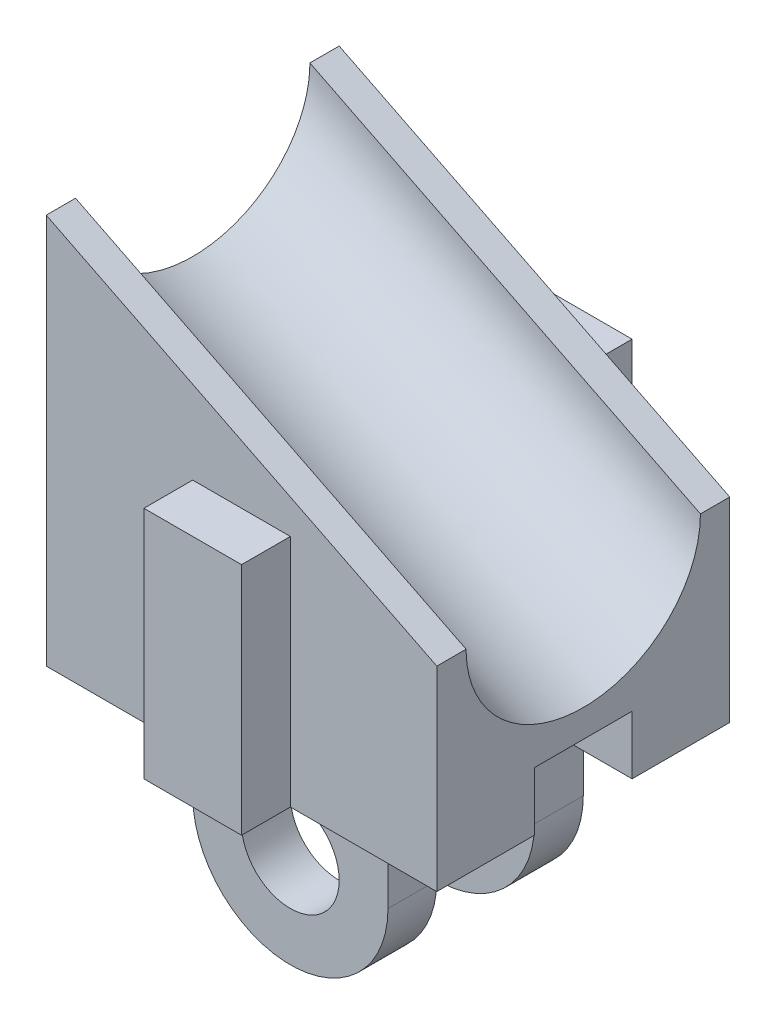
ISO-10303-21;
HEADER;
FILE_DESCRIPTION(('STEP AP214'),'2;1');
FILE_NAME('part.step','',(''),(''),'','','');
FILE_SCHEMA(('AUTOMOTIVE_DESIGN { 1 0 10303 214 1 1 1 1 }'));
ENDSEC;
DATA;
#1=APPLICATION_CONTEXT('core data for automotive mechanical design processes');
#2=APPLICATION_PROTOCOL_DEFINITION('international standard','automotive_design',2000,#1);
#3=PRODUCT_CONTEXT('',#1,'mechanical');
#4=PRODUCT('Part','Part','',(#3));
#5=PRODUCT_RELATED_PRODUCT_CATEGORY('part','',(#4));
#6=PRODUCT_DEFINITION_FORMATION('','',#4);
#7=PRODUCT_DEFINITION_CONTEXT('part definition',#1,'design');
#8=PRODUCT_DEFINITION('design','',#6,#7);
#9=PRODUCT_DEFINITION_SHAPE('','',#8);
#10=(LENGTH_UNIT() NAMED_UNIT(*) SI_UNIT(.MILLI.,.METRE.));
#11=(NAMED_UNIT(*) PLANE_ANGLE_UNIT() SI_UNIT($,.RADIAN.));
#12=(NAMED_UNIT(*) SI_UNIT($,.STERADIAN.) SOLID_ANGLE_UNIT());
#13=UNCERTAINTY_MEASURE_WITH_UNIT(LENGTH_MEASURE(1.E-05),#10,'distance_accuracy_value','');
#14=(GEOMETRIC_REPRESENTATION_CONTEXT(3) GLOBAL_UNCERTAINTY_ASSIGNED_CONTEXT((#13)) GLOBAL_UNIT_ASSIGNED_CONTEXT((#10,
#11,#12)) REPRESENTATION_CONTEXT('',''));
#15=CARTESIAN_POINT('',(0.,0.,0.));
#16=DIRECTION('',(0.,0.,1.));
#17=DIRECTION('',(1.,0.,0.));
#18=AXIS2_PLACEMENT_3D('',#15,#16,#17);
#19=CARTESIAN_POINT('',(0.,0.,-9.525));
#20=DIRECTION('',(0.,0.,-1.));
#21=DIRECTION('',(-1.,0.,0.));
#22=AXIS2_PLACEMENT_3D('',#19,#20,#21);
#23=PLANE('',#22);
#24=DIRECTION('',(-1.,0.,0.));
#25=VECTOR('',#24,1.);
#26=CARTESIAN_POINT('',(-3.175,2.54,-9.525));
#27=LINE('',#26,#25);
#28=CARTESIAN_POINT('',(3.175,2.54,-9.525));
#29=VERTEX_POINT('',#28);
#30=CARTESIAN_POINT('',(-3.175,2.54,-9.525));
#31=VERTEX_POINT('',#30);
#32=EDGE_CURVE('E435',#29,#31,#27,.T.);
#33=ORIENTED_EDGE('',*,*,#32,.T.);
#34=DIRECTION('',(0.,-1.,0.));
#35=VECTOR('',#34,1.);
#36=CARTESIAN_POINT('',(-3.175,-12.7,-9.525));
#37=LINE('',#36,#35);
#38=CARTESIAN_POINT('',(-3.175,-12.7,-9.525));
#39=VERTEX_POINT('',#38);
#40=EDGE_CURVE('E439',#31,#39,#37,.T.);
#41=ORIENTED_EDGE('',*,*,#40,.T.);
#42=DIRECTION('',(1.,0.,0.));
#43=VECTOR('',#42,1.);
#44=CARTESIAN_POINT('',(-12.7,-12.7,-9.525));
#45=LINE('',#44,#43);
#46=CARTESIAN_POINT('',(-12.7,-12.7,-9.525));
#47=VERTEX_POINT('',#46);
#48=EDGE_CURVE('E285',#47,#39,#45,.T.);
#49=ORIENTED_EDGE('',*,*,#48,.F.);
#50=DIRECTION('',(0.,-1.,0.));
#51=VECTOR('',#50,1.);
#52=CARTESIAN_POINT('',(-12.7,-12.7,-9.525));
#53=LINE('',#52,#51);
#54=CARTESIAN_POINT('',(-12.7,12.7,-9.525));
#55=VERTEX_POINT('',#54);
#56=EDGE_CURVE('E290',#55,#47,#53,.T.);
#57=ORIENTED_EDGE('',*,*,#56,.F.);
#58=DIRECTION('',(-0.894427190999916,0.447213595499958,0.));
#59=VECTOR('',#58,1.);
#60=CARTESIAN_POINT('',(-12.7,12.7,-9.525));
#61=LINE('',#60,#59);
#62=CARTESIAN_POINT('',(12.7,0.,-9.525));
#63=VERTEX_POINT('',#62);
#64=EDGE_CURVE('E279',#63,#55,#61,.T.);
#65=ORIENTED_EDGE('',*,*,#64,.F.);
#66=DIRECTION('',(0.,1.,0.));
#67=VECTOR('',#66,1.);
#68=CARTESIAN_POINT('',(12.7,-12.7,-9.525));
#69=LINE('',#68,#67);
#70=CARTESIAN_POINT('',(12.7,-12.7,-9.525));
#71=VERTEX_POINT('',#70);
#72=EDGE_CURVE('E266',#71,#63,#69,.T.);
#73=ORIENTED_EDGE('',*,*,#72,.F.);
#74=CARTESIAN_POINT('',(3.175,-12.7,-9.525));
#75=VERTEX_POINT('',#74);
#76=EDGE_CURVE('E289',#75,#71,#45,.T.);
#77=ORIENTED_EDGE('',*,*,#76,.F.);
#78=DIRECTION('',(0.,1.,0.));
#79=VECTOR('',#78,1.);
#80=CARTESIAN_POINT('',(3.175,-12.7,-9.525));
#81=LINE('',#80,#79);
#82=EDGE_CURVE('E430',#75,#29,#81,.T.);
#83=ORIENTED_EDGE('',*,*,#82,.T.);
#84=EDGE_LOOP('',(#33,#41,#49,#57,#65,#73,#77,#83));
#85=FACE_BOUND('',#84,.T.);
#86=ADVANCED_FACE('F39',(#85),#23,.T.);
#87=CARTESIAN_POINT('',(0.,0.,9.525));
#88=DIRECTION('',(0.,0.,-1.));
#89=DIRECTION('',(-1.,0.,0.));
#90=AXIS2_PLACEMENT_3D('',#87,#88,#89);
#91=PLANE('',#90);
#92=DIRECTION('',(0.,-1.,0.));
#93=VECTOR('',#92,1.);
#94=CARTESIAN_POINT('',(-3.175,-12.7,9.525));
#95=LINE('',#94,#93);
#96=CARTESIAN_POINT('',(-3.175,2.54,9.525));
#97=VERTEX_POINT('',#96);
#98=CARTESIAN_POINT('',(-3.175,-12.7,9.525));
#99=VERTEX_POINT('',#98);
#100=EDGE_CURVE('E357',#97,#99,#95,.T.);
#101=ORIENTED_EDGE('',*,*,#100,.F.);
#102=DIRECTION('',(-1.,0.,0.));
#103=VECTOR('',#102,1.);
#104=CARTESIAN_POINT('',(-3.175,2.54,9.525));
#105=LINE('',#104,#103);
#106=CARTESIAN_POINT('',(3.175,2.54,9.525));
#107=VERTEX_POINT('',#106);
#108=EDGE_CURVE('E348',#107,#97,#105,.T.);
#109=ORIENTED_EDGE('',*,*,#108,.F.);
#110=DIRECTION('',(0.,1.,0.));
#111=VECTOR('',#110,1.);
#112=CARTESIAN_POINT('',(3.175,-12.7,9.525));
#113=LINE('',#112,#111);
#114=CARTESIAN_POINT('',(3.17499999999999,-12.7,9.525));
#115=VERTEX_POINT('',#114);
#116=EDGE_CURVE('E353',#115,#107,#113,.T.);
#117=ORIENTED_EDGE('',*,*,#116,.F.);
#118=DIRECTION('',(1.,0.,0.));
#119=VECTOR('',#118,1.);
#120=CARTESIAN_POINT('',(-12.7,-12.7,9.525));
#121=LINE('',#120,#119);
#122=CARTESIAN_POINT('',(12.7,-12.7,9.525));
#123=VERTEX_POINT('',#122);
#124=EDGE_CURVE('E302',#115,#123,#121,.T.);
#125=ORIENTED_EDGE('',*,*,#124,.T.);
#126=DIRECTION('',(0.,1.,0.));
#127=VECTOR('',#126,1.);
#128=CARTESIAN_POINT('',(12.7,-12.7,9.525));
#129=LINE('',#128,#127);
#130=CARTESIAN_POINT('',(12.7,0.,9.525));
#131=VERTEX_POINT('',#130);
#132=EDGE_CURVE('E238',#123,#131,#129,.T.);
#133=ORIENTED_EDGE('',*,*,#132,.T.);
#134=DIRECTION('',(-0.894427190999916,0.447213595499958,0.));
#135=VECTOR('',#134,1.);
#136=CARTESIAN_POINT('',(-12.7,12.7,9.525));
#137=LINE('',#136,#135);
#138=CARTESIAN_POINT('',(-12.7,12.7,9.525));
#139=VERTEX_POINT('',#138);
#140=EDGE_CURVE('E277',#131,#139,#137,.T.);
#141=ORIENTED_EDGE('',*,*,#140,.T.);
#142=DIRECTION('',(0.,-1.,0.));
#143=VECTOR('',#142,1.);
#144=CARTESIAN_POINT('',(-12.7,-12.7,9.525));
#145=LINE('',#144,#143);
#146=CARTESIAN_POINT('',(-12.7,-12.7,9.525));
#147=VERTEX_POINT('',#146);
#148=EDGE_CURVE('E282',#139,#147,#145,.T.);
#149=ORIENTED_EDGE('',*,*,#148,.T.);
#150=EDGE_CURVE('E299',#147,#99,#121,.T.);
#151=ORIENTED_EDGE('',*,*,#150,.T.);
#152=EDGE_LOOP('',(#101,#109,#117,#125,#133,#141,#149,#151));
#153=FACE_BOUND('',#152,.T.);
#154=ADVANCED_FACE('F326',(#153),#91,.F.);
#155=CARTESIAN_POINT('',(-12.7,12.7,9.525));
#156=DIRECTION('',(-0.447213595499958,-0.894427190999916,0.));
#157=DIRECTION('',(0.894427190999916,-0.447213595499958,0.));
#158=AXIS2_PLACEMENT_3D('',#155,#156,#157);
#159=PLANE('',#158);
#160=DIRECTION('',(0.,0.,-1.));
#161=VECTOR('',#160,1.);
#162=CARTESIAN_POINT('',(12.7,0.,9.525));
#163=LINE('',#162,#161);
#164=CARTESIAN_POINT('',(12.7,0.,7.62));
#165=VERTEX_POINT('',#164);
#166=EDGE_CURVE('E247',#131,#165,#163,.T.);
#167=ORIENTED_EDGE('',*,*,#166,.T.);
#168=DIRECTION('',(-0.894427190999916,0.447213595499958,0.));
#169=VECTOR('',#168,1.);
#170=CARTESIAN_POINT('',(17.78,-2.54,7.62));
#171=LINE('',#170,#169);
#172=CARTESIAN_POINT('',(-12.7,12.7,7.62));
#173=VERTEX_POINT('',#172);
#174=EDGE_CURVE('E11',#165,#173,#171,.T.);
#175=ORIENTED_EDGE('',*,*,#174,.T.);
#176=DIRECTION('',(0.,0.,-1.));
#177=VECTOR('',#176,1.);
#178=CARTESIAN_POINT('',(-12.7,12.7,9.525));
#179=LINE('',#178,#177);
#180=EDGE_CURVE('E269',#139,#173,#179,.T.);
#181=ORIENTED_EDGE('',*,*,#180,.F.);
#182=ORIENTED_EDGE('',*,*,#140,.F.);
#183=EDGE_LOOP('',(#167,#175,#181,#182));
#184=FACE_BOUND('',#183,.T.);
#185=ADVANCED_FACE('F566',(#184),#159,.F.);
#186=CARTESIAN_POINT('',(-12.7,-12.7,9.525));
#187=DIRECTION('',(1.,0.,0.));
#188=DIRECTION('',(0.,0.,-1.));
#189=AXIS2_PLACEMENT_3D('',#186,#187,#188);
#190=PLANE('',#189);
#191=ORIENTED_EDGE('',*,*,#180,.T.);
#192=CARTESIAN_POINT('',(-12.7,12.7,7.62));
#193=CARTESIAN_POINT('',(-12.7,12.5149642446098,7.62002681091608));
#194=CARTESIAN_POINT('',(-12.7,12.3299365958363,7.61223692132798));
#195=CARTESIAN_POINT('',(-12.7,11.9607628118652,7.58118299104947));
#196=CARTESIAN_POINT('',(-12.7,11.7766196050152,7.55788409878131));
#197=CARTESIAN_POINT('',(-12.7,11.4085383062811,7.49556873286503));
#198=CARTESIAN_POINT('',(-12.7,11.2246342941641,7.45635098312844));
#199=CARTESIAN_POINT('',(-12.7,10.8606988083788,7.36257464699975));
#200=CARTESIAN_POINT('',(-12.7,10.6806690620895,7.30800936430437));
#201=CARTESIAN_POINT('',(-12.7,10.3258823491836,7.18410042669397));
#202=CARTESIAN_POINT('',(-12.7,10.151122607359,7.11476471076534));
#203=CARTESIAN_POINT('',(-12.7,9.80797907736589,6.96197186445175));
#204=CARTESIAN_POINT('',(-12.7,9.63959276934698,6.87852038788491));
#205=CARTESIAN_POINT('',(-12.7,9.31040995566306,6.69835556286705));
#206=CARTESIAN_POINT('',(-12.7,9.1496023236914,6.60166252487826));
#207=CARTESIAN_POINT('',(-12.7,8.83625929037397,6.39575244510815));
#208=CARTESIAN_POINT('',(-12.7,8.68372262539535,6.28653732442828));
#209=CARTESIAN_POINT('',(-12.7,8.38600824785983,6.05511682319289));
#210=CARTESIAN_POINT('',(-12.7,8.24093596286957,5.9327758949894));
#211=CARTESIAN_POINT('',(-12.7,7.96076654746212,5.67706494972102));
#212=CARTESIAN_POINT('',(-12.7,7.82567335359387,5.54369062372239));
#213=CARTESIAN_POINT('',(-12.7,7.56612171184581,5.26688201550798));
#214=CARTESIAN_POINT('',(-12.7000000000001,7.44166718147907,5.12344406262531));
#215=CARTESIAN_POINT('',(-12.6999999999999,7.20399304645945,4.82754035249018));
#216=CARTESIAN_POINT('',(-12.6999999999998,7.09077414225601,4.67507403333779));
#217=CARTESIAN_POINT('',(-12.6999999999997,6.86779582892949,4.35009853984493));
#218=CARTESIAN_POINT('',(-12.6999999999999,6.75896863962169,4.176949153372));
#219=CARTESIAN_POINT('',(-12.7000000000001,6.5554590247287,3.82275461808736));
#220=CARTESIAN_POINT('',(-12.7,6.46076352427677,3.64171697055643));
#221=CARTESIAN_POINT('',(-12.7,6.28576163387965,3.27278877754629));
#222=CARTESIAN_POINT('',(-12.7,6.20545730866336,3.08489725337529));
#223=CARTESIAN_POINT('',(-12.7,6.05953958739306,2.70345232727515));
#224=CARTESIAN_POINT('',(-12.7,5.99392937219897,2.50989770967909));
#225=CARTESIAN_POINT('',(-12.7,5.87766626795796,2.11840450080426));
#226=CARTESIAN_POINT('',(-12.7,5.82700958173782,1.92046703621653));
#227=CARTESIAN_POINT('',(-12.7,5.74079888622651,1.52133336315089));
#228=CARTESIAN_POINT('',(-12.7,5.70524485411743,1.32013715959694));
#229=CARTESIAN_POINT('',(-12.7,5.64935165632706,0.915637922899494));
#230=CARTESIAN_POINT('',(-12.7,5.62901289489024,0.712334833925035));
#231=CARTESIAN_POINT('',(-12.7,5.60361602393815,0.304821662719376));
#232=CARTESIAN_POINT('',(-12.7,5.59855481352632,0.100611772970326));
#233=CARTESIAN_POINT('',(-12.7,5.60372269018371,-0.307557833104586));
#234=CARTESIAN_POINT('',(-12.7,5.61394668737259,-0.511517610084399));
#235=CARTESIAN_POINT('',(-12.7,5.64964531299941,-0.918233497709904));
#236=CARTESIAN_POINT('',(-12.7,5.67513308114988,-1.12098841911494));
#237=CARTESIAN_POINT('',(-12.7,5.77518596275477,-1.73021960029369));
#238=CARTESIAN_POINT('',(-12.7,5.87328601031775,-2.13308669521919));
#239=CARTESIAN_POINT('',(-12.7,6.13053358975907,-2.91888203112899));
#240=CARTESIAN_POINT('',(-12.7,6.28967619865457,-3.30181187719209));
#241=CARTESIAN_POINT('',(-12.7,6.5789083793745,-3.8668229849128));
#242=CARTESIAN_POINT('',(-12.7,6.68827979255772,-4.05973802971004));
#243=CARTESIAN_POINT('',(-12.7,6.92321534190889,-4.43528924637211));
#244=CARTESIAN_POINT('',(-12.7,7.04876579403904,-4.61793391939531));
#245=CARTESIAN_POINT('',(-12.7,7.30566265569277,-4.95852242504652));
#246=CARTESIAN_POINT('',(-12.7000000000001,7.4359119080247,-5.11729569139285));
#247=CARTESIAN_POINT('',(-12.6999999999999,7.70914997415411,-5.42352748880028));
#248=CARTESIAN_POINT('',(-12.6999999999997,7.85214014101082,-5.57098481502914));
#249=CARTESIAN_POINT('',(-12.6999999999998,8.1450594903248,-5.84857176700443));
#250=CARTESIAN_POINT('',(-12.7,8.29459522235026,-5.97911662218714));
#251=CARTESIAN_POINT('',(-12.7,8.60405184568026,-6.22740221298924));
#252=CARTESIAN_POINT('',(-12.6999999999998,8.76397667182098,-6.34513805154377));
#253=CARTESIAN_POINT('',(-12.6999999999998,9.08811306391519,-6.56327422765334));
#254=CARTESIAN_POINT('',(-12.7,9.25204008671896,-6.6640973798525));
#255=CARTESIAN_POINT('',(-12.7,9.58763065344741,-6.85174207529673));
#256=CARTESIAN_POINT('',(-12.6999999999999,9.75929050448968,-6.93857021316441));
#257=CARTESIAN_POINT('',(-12.6999999999999,10.1050223917272,-7.09552863670346));
#258=CARTESIAN_POINT('',(-12.7,10.2789325986482,-7.16601554674021));
#259=CARTESIAN_POINT('',(-12.7,10.6320453268356,-7.29231355092473));
#260=CARTESIAN_POINT('',(-12.7,10.8112484887328,-7.34812286041171));
#261=CARTESIAN_POINT('',(-12.7,11.131387238018,-7.4332674091789));
#262=CARTESIAN_POINT('',(-12.7,11.271496952904,-7.46574140901344));
#263=CARTESIAN_POINT('',(-12.7,11.5535537861653,-7.52156725603838));
#264=CARTESIAN_POINT('',(-12.7,11.6955012008707,-7.54491761262132));
#265=CARTESIAN_POINT('',(-12.7,11.9809051105192,-7.5823844280539));
#266=CARTESIAN_POINT('',(-12.7,12.1243641053535,-7.59648183098476));
#267=CARTESIAN_POINT('',(-12.7,12.4118811681076,-7.61529402806894));
#268=CARTESIAN_POINT('',(-12.7,12.5559391744941,-7.62000976320242));
#269=CARTESIAN_POINT('',(-12.7,12.7,-7.62));
#270=B_SPLINE_CURVE_WITH_KNOTS('',3,(#192,#193,#194,#195,#196,#197,#198,#199,#200,#201,#202,
#203,#204,#205,#206,#207,#208,#209,#210,#211,#212,#213,#214,#215,#216,#217,#218,#219,#220,#221,
#222,#223,#224,#225,#226,#227,#228,#229,#230,#231,#232,#233,#234,#235,#236,#237,#238,#239,#240,
#241,#242,#243,#244,#245,#246,#247,#248,#249,#250,#251,#252,#253,#254,#255,#256,#257,#258,#259,
#260,#261,#262,#263,#264,#265,#266,#267,#268,#269),.UNSPECIFIED.,.F.,.F.,(4,2,2,2,2,2,2,2,2,2,2,
2,2,2,2,2,2,2,2,2,2,2,2,2,2,2,2,2,2,2,2,2,2,2,2,2,2,2,4),(0.,0.554930641301886,1.11111254260786,
1.67455738510785,2.23824844737322,2.80163729135045,3.36480101192687,3.92711040661341,
4.48933364857291,5.05805485104376,5.62699921748157,6.1961521938679,6.76534063002833,
7.37820828386281,7.99050533949808,8.60289017233238,9.21540744133493,9.82776903879892,
10.4401297110702,11.0525066521697,11.6647592902792,12.2768080974214,12.8893845414722,
14.1281248604757,15.3667652980941,16.031345279396,16.6953668114985,17.3107774727153,
17.9262535673654,18.5210917436921,19.1161565416226,19.6928596737396,20.2692902567378,
20.8316147057512,21.3940074966505,21.8251956808931,22.2564542826022,22.6885982725235,
23.1206989162679),.UNSPECIFIED.);
#271=CARTESIAN_POINT('',(-12.7,12.7,-7.62));
#272=VERTEX_POINT('',#271);
#273=EDGE_CURVE('E294',#173,#272,#270,.T.);
#274=ORIENTED_EDGE('',*,*,#273,.T.);
#275=EDGE_CURVE('E259',#272,#55,#179,.T.);
#276=ORIENTED_EDGE('',*,*,#275,.T.);
#277=ORIENTED_EDGE('',*,*,#56,.T.);
#278=DIRECTION('',(0.,0.,-1.));
#279=VECTOR('',#278,1.);
#280=CARTESIAN_POINT('',(-12.7,-12.7,9.525));
#281=LINE('',#280,#279);
#282=EDGE_CURVE('E240',#147,#47,#281,.T.);
#283=ORIENTED_EDGE('',*,*,#282,.F.);
#284=ORIENTED_EDGE('',*,*,#148,.F.);
#285=EDGE_LOOP('',(#191,#274,#276,#277,#283,#284));
#286=FACE_BOUND('',#285,.T.);
#287=ADVANCED_FACE('F41',(#286),#190,.F.);
#288=CARTESIAN_POINT('',(-12.7,-12.7,9.525));
#289=DIRECTION('',(0.,1.,0.));
#290=DIRECTION('',(0.,0.,1.));
#291=AXIS2_PLACEMENT_3D('',#288,#289,#290);
#292=PLANE('',#291);
#293=DIRECTION('',(0.,0.,-1.));
#294=VECTOR('',#293,1.);
#295=CARTESIAN_POINT('',(6.35,-12.7,6.35));
#296=LINE('',#295,#294);
#297=CARTESIAN_POINT('',(6.35,-12.7,6.35));
#298=VERTEX_POINT('',#297);
#299=CARTESIAN_POINT('',(6.35,-12.7,3.175));
#300=VERTEX_POINT('',#299);
#301=EDGE_CURVE('E231',#298,#300,#296,.T.);
#302=ORIENTED_EDGE('',*,*,#301,.T.);
#303=DIRECTION('',(1.,0.,0.));
#304=VECTOR('',#303,1.);
#305=CARTESIAN_POINT('',(-13.7553089064535,-12.7,3.175));
#306=LINE('',#305,#304);
#307=CARTESIAN_POINT('',(12.7,-12.7,3.175));
#308=VERTEX_POINT('',#307);
#309=EDGE_CURVE('E212',#300,#308,#306,.T.);
#310=ORIENTED_EDGE('',*,*,#309,.T.);
#311=DIRECTION('',(0.,0.,-1.));
#312=VECTOR('',#311,1.);
#313=CARTESIAN_POINT('',(12.7,-12.7,9.525));
#314=LINE('',#313,#312);
#315=EDGE_CURVE('E227',#123,#308,#314,.T.);
#316=ORIENTED_EDGE('',*,*,#315,.F.);
#317=ORIENTED_EDGE('',*,*,#124,.F.);
#318=DIRECTION('',(0.,0.,-1.));
#319=VECTOR('',#318,1.);
#320=CARTESIAN_POINT('',(3.175,-12.7,12.7));
#321=LINE('',#320,#319);
#322=CARTESIAN_POINT('',(3.175,-12.7,12.7));
#323=VERTEX_POINT('',#322);
#324=EDGE_CURVE('E335',#323,#115,#321,.T.);
#325=ORIENTED_EDGE('',*,*,#324,.F.);
#326=DIRECTION('',(1.,0.,0.));
#327=VECTOR('',#326,1.);
#328=CARTESIAN_POINT('',(-3.175,-12.7,12.7));
#329=LINE('',#328,#327);
#330=CARTESIAN_POINT('',(-3.175,-12.7,12.7));
#331=VERTEX_POINT('',#330);
#332=EDGE_CURVE('E367',#331,#323,#329,.T.);
#333=ORIENTED_EDGE('',*,*,#332,.F.);
#334=DIRECTION('',(0.,0.,-1.));
#335=VECTOR('',#334,1.);
#336=CARTESIAN_POINT('',(-3.175,-12.7,12.7));
#337=LINE('',#336,#335);
#338=EDGE_CURVE('E331',#331,#99,#337,.T.);
#339=ORIENTED_EDGE('',*,*,#338,.T.);
#340=ORIENTED_EDGE('',*,*,#150,.F.);
#341=ORIENTED_EDGE('',*,*,#282,.T.);
#342=ORIENTED_EDGE('',*,*,#48,.T.);
#343=DIRECTION('',(0.,0.,1.));
#344=VECTOR('',#343,1.);
#345=CARTESIAN_POINT('',(-3.175,-12.7,-12.7));
#346=LINE('',#345,#344);
#347=CARTESIAN_POINT('',(-3.175,-12.7,-12.7));
#348=VERTEX_POINT('',#347);
#349=EDGE_CURVE('E426',#348,#39,#346,.T.);
#350=ORIENTED_EDGE('',*,*,#349,.F.);
#351=DIRECTION('',(1.,0.,0.));
#352=VECTOR('',#351,1.);
#353=CARTESIAN_POINT('',(-3.175,-12.7,-12.7));
#354=LINE('',#353,#352);
#355=CARTESIAN_POINT('',(3.175,-12.7,-12.7));
#356=VERTEX_POINT('',#355);
#357=EDGE_CURVE('E429',#348,#356,#354,.T.);
#358=ORIENTED_EDGE('',*,*,#357,.T.);
#359=DIRECTION('',(0.,0.,1.));
#360=VECTOR('',#359,1.);
#361=CARTESIAN_POINT('',(3.175,-12.7,-12.7));
#362=LINE('',#361,#360);
#363=EDGE_CURVE('E423',#356,#75,#362,.T.);
#364=ORIENTED_EDGE('',*,*,#363,.T.);
#365=ORIENTED_EDGE('',*,*,#76,.T.);
#366=CARTESIAN_POINT('',(12.7,-12.7,-3.175));
#367=VERTEX_POINT('',#366);
#368=EDGE_CURVE('E241',#367,#71,#314,.T.);
#369=ORIENTED_EDGE('',*,*,#368,.F.);
#370=DIRECTION('',(1.,0.,0.));
#371=VECTOR('',#370,1.);
#372=CARTESIAN_POINT('',(-13.7553089064535,-12.7,-3.175));
#373=LINE('',#372,#371);
#374=CARTESIAN_POINT('',(6.35,-12.7,-3.175));
#375=VERTEX_POINT('',#374);
#376=EDGE_CURVE('E233',#375,#367,#373,.T.);
#377=ORIENTED_EDGE('',*,*,#376,.F.);
#378=DIRECTION('',(0.,0.,1.));
#379=VECTOR('',#378,1.);
#380=CARTESIAN_POINT('',(6.35,-12.7,-6.35));
#381=LINE('',#380,#379);
#382=CARTESIAN_POINT('',(6.35,-12.7,-6.35));
#383=VERTEX_POINT('',#382);
#384=EDGE_CURVE('E56',#383,#375,#381,.T.);
#385=ORIENTED_EDGE('',*,*,#384,.F.);
#386=DIRECTION('',(-1.,0.,0.));
#387=VECTOR('',#386,1.);
#388=CARTESIAN_POINT('',(-6.35,-12.7,-6.35));
#389=LINE('',#388,#387);
#390=CARTESIAN_POINT('',(-6.35,-12.7,-6.35));
#391=VERTEX_POINT('',#390);
#392=EDGE_CURVE('E60',#383,#391,#389,.T.);
#393=ORIENTED_EDGE('',*,*,#392,.T.);
#394=DIRECTION('',(0.,0.,1.));
#395=VECTOR('',#394,1.);
#396=CARTESIAN_POINT('',(-6.35,-12.7,-6.35));
#397=LINE('',#396,#395);
#398=CARTESIAN_POINT('',(-6.35,-12.7,-3.175));
#399=VERTEX_POINT('',#398);
#400=EDGE_CURVE('E465',#391,#399,#397,.T.);
#401=ORIENTED_EDGE('',*,*,#400,.T.);
#402=DIRECTION('',(0.,0.,1.));
#403=VECTOR('',#402,1.);
#404=CARTESIAN_POINT('',(-6.35,-12.7,3.175));
#405=LINE('',#404,#403);
#406=CARTESIAN_POINT('',(-6.35,-12.7,3.175));
#407=VERTEX_POINT('',#406);
#408=EDGE_CURVE('E499',#399,#407,#405,.T.);
#409=ORIENTED_EDGE('',*,*,#408,.T.);
#410=DIRECTION('',(0.,0.,-1.));
#411=VECTOR('',#410,1.);
#412=CARTESIAN_POINT('',(-6.35,-12.7,6.35));
#413=LINE('',#412,#411);
#414=CARTESIAN_POINT('',(-6.35,-12.7,6.35));
#415=VERTEX_POINT('',#414);
#416=EDGE_CURVE('E361',#415,#407,#413,.T.);
#417=ORIENTED_EDGE('',*,*,#416,.F.);
#418=DIRECTION('',(-1.,0.,0.));
#419=VECTOR('',#418,1.);
#420=CARTESIAN_POINT('',(-6.35,-12.7,6.35));
#421=LINE('',#420,#419);
#422=EDGE_CURVE('E390',#298,#415,#421,.T.);
#423=ORIENTED_EDGE('',*,*,#422,.F.);
#424=EDGE_LOOP('',(#302,#310,#316,#317,#325,#333,#339,#340,#341,#342,#350,#358,#364,#365,#369,
#377,#385,#393,#401,#409,#417,#423));
#425=FACE_BOUND('',#424,.T.);
#426=ADVANCED_FACE('F225',(#425),#292,.F.);
#427=CARTESIAN_POINT('',(12.7,-12.7,9.525));
#428=DIRECTION('',(-1.,0.,0.));
#429=DIRECTION('',(0.,0.,1.));
#430=AXIS2_PLACEMENT_3D('',#427,#428,#429);
#431=PLANE('',#430);
#432=ORIENTED_EDGE('',*,*,#315,.T.);
#433=DIRECTION('',(0.,-1.,0.));
#434=VECTOR('',#433,1.);
#435=CARTESIAN_POINT('',(12.7,-12.7,3.175));
#436=LINE('',#435,#434);
#437=CARTESIAN_POINT('',(12.7,-8.89,3.175));
#438=VERTEX_POINT('',#437);
#439=EDGE_CURVE('E206',#438,#308,#436,.T.);
#440=ORIENTED_EDGE('',*,*,#439,.F.);
#441=DIRECTION('',(0.,0.,1.));
#442=VECTOR('',#441,1.);
#443=CARTESIAN_POINT('',(12.7,-8.89,3.175));
#444=LINE('',#443,#442);
#445=CARTESIAN_POINT('',(12.7,-8.89,-3.175));
#446=VERTEX_POINT('',#445);
#447=EDGE_CURVE('E234',#446,#438,#444,.T.);
#448=ORIENTED_EDGE('',*,*,#447,.F.);
#449=DIRECTION('',(0.,1.,0.));
#450=VECTOR('',#449,1.);
#451=CARTESIAN_POINT('',(12.7,-12.7,-3.175));
#452=LINE('',#451,#450);
#453=EDGE_CURVE('E221',#367,#446,#452,.T.);
#454=ORIENTED_EDGE('',*,*,#453,.F.);
#455=ORIENTED_EDGE('',*,*,#368,.T.);
#456=ORIENTED_EDGE('',*,*,#72,.T.);
#457=CARTESIAN_POINT('',(12.7,0.,-7.61999999999999));
#458=VERTEX_POINT('',#457);
#459=EDGE_CURVE('E257',#458,#63,#163,.T.);
#460=ORIENTED_EDGE('',*,*,#459,.F.);
#461=CARTESIAN_POINT('',(12.7,0.,-7.62));
#462=CARTESIAN_POINT('',(12.7,-0.185240855479206,-7.62002704055622));
#463=CARTESIAN_POINT('',(12.7,-0.370474366388034,-7.61221970793246));
#464=CARTESIAN_POINT('',(12.7,-0.739645865960692,-7.58113124861835));
#465=CARTESIAN_POINT('',(12.7,-0.923583810321581,-7.5578495953424));
#466=CARTESIAN_POINT('',(12.7,-1.28887248967454,-7.49600714516068));
#467=CARTESIAN_POINT('',(12.7,-1.47022319731826,-7.457446186869));
#468=CARTESIAN_POINT('',(12.7,-1.82906033349357,-7.36543365722707));
#469=CARTESIAN_POINT('',(12.7,-2.00654760881248,-7.31198538504267));
#470=CARTESIAN_POINT('',(12.7,-2.35644897960765,-7.19071879078484));
#471=CARTESIAN_POINT('',(12.7,-2.52886532901188,-7.12290696641799));
#472=CARTESIAN_POINT('',(12.7,-2.86775356537184,-6.97345189751819));
#473=CARTESIAN_POINT('',(12.7,-3.034220603481,-6.89179766891053));
#474=CARTESIAN_POINT('',(12.7,-3.36199623959889,-6.71435732883864));
#475=CARTESIAN_POINT('',(12.7,-3.52322036244639,-6.61841525826525));
#476=CARTESIAN_POINT('',(12.7,-3.83753852115202,-6.41390423683537));
#477=CARTESIAN_POINT('',(12.7,-3.99062911886406,-6.30533000709734));
#478=CARTESIAN_POINT('',(12.7,-4.28776705264286,-6.07646779035187));
#479=CARTESIAN_POINT('',(12.6999999999998,-4.43181495909571,-5.95618054339027));
#480=CARTESIAN_POINT('',(12.7000000000002,-4.71015523895108,-5.70480083880227));
#481=CARTESIAN_POINT('',(12.7000000000006,-4.84444692765369,-5.57370762417911));
#482=CARTESIAN_POINT('',(12.7000000000006,-5.1095882371763,-5.29433282599979));
#483=CARTESIAN_POINT('',(12.7000000000002,-5.23986431564695,-5.14550600830022));
#484=CARTESIAN_POINT('',(12.6999999999998,-5.48819571007229,-4.83810329582245));
#485=CARTESIAN_POINT('',(12.6999999999999,-5.60625387612528,-4.67952968851794));
#486=CARTESIAN_POINT('',(12.7000000000001,-5.94391351846319,-4.18703664767327));
#487=CARTESIAN_POINT('',(12.7,-6.14403335896724,-3.839487127171));
#488=CARTESIAN_POINT('',(12.7,-6.48904548961344,-3.11784910553367));
#489=CARTESIAN_POINT('',(12.7,-6.63390312388376,-2.74374412483894));
#490=CARTESIAN_POINT('',(12.7,-6.81315933553517,-2.15345823747204));
#491=CARTESIAN_POINT('',(12.7,-6.86778758915408,-1.94321012720699));
#492=CARTESIAN_POINT('',(12.7,-6.95994650697209,-1.51916230800322));
#493=CARTESIAN_POINT('',(12.7,-6.99749289526946,-1.30536605388733));
#494=CARTESIAN_POINT('',(12.7,-7.05541382805018,-0.875417327280764));
#495=CARTESIAN_POINT('',(12.7,-7.07578392917104,-0.659264259741627));
#496=CARTESIAN_POINT('',(12.7,-7.09927355740553,-0.225971601937268));
#497=CARTESIAN_POINT('',(12.7,-7.10238917697197,-0.00883179935254644));
#498=CARTESIAN_POINT('',(12.7,-7.091348663796,0.424947935291856));
#499=CARTESIAN_POINT('',(12.7,-7.07719729169316,0.641587988640121));
#500=CARTESIAN_POINT('',(12.7,-7.03167250452566,1.07312528915357));
#501=CARTESIAN_POINT('',(12.7,-7.0002934101364,1.28802193786447));
#502=CARTESIAN_POINT('',(12.7,-6.92042966628144,1.71456300264681));
#503=CARTESIAN_POINT('',(12.7,-6.87194907908697,1.92620817862146));
#504=CARTESIAN_POINT('',(12.7,-6.75804014848023,2.34496841533654));
#505=CARTESIAN_POINT('',(12.7000000000001,-6.69260614660659,2.55208193849156));
#506=CARTESIAN_POINT('',(12.7,-6.54506266419828,2.96025616558105));
#507=CARTESIAN_POINT('',(12.7,-6.46295539242703,3.16131766720017));
#508=CARTESIAN_POINT('',(12.7,-6.28237287940014,3.55603386052446));
#509=CARTESIAN_POINT('',(12.7000000000002,-6.1838927174722,3.74968630393956));
#510=CARTESIAN_POINT('',(12.7000000000002,-5.97391309935711,4.12292016801811));
#511=CARTESIAN_POINT('',(12.7,-5.86283867358938,4.30274067025968));
#512=CARTESIAN_POINT('',(12.7,-5.62615449638784,4.65254254157336));
#513=CARTESIAN_POINT('',(12.7000000000003,-5.5005457977382,4.82252462195118));
#514=CARTESIAN_POINT('',(12.7000000000002,-5.23992507983245,5.14570325133556));
#515=CARTESIAN_POINT('',(12.7,-5.10537661811862,5.29927361209827));
#516=CARTESIAN_POINT('',(12.7,-4.82404651246558,5.59466749577244));
#517=CARTESIAN_POINT('',(12.7000000000002,-4.67726979016142,5.73649569928512));
#518=CARTESIAN_POINT('',(12.7000000000002,-4.37734874650449,6.00273951395996));
#519=CARTESIAN_POINT('',(12.7,-4.2245798239532,6.12757798765397));
#520=CARTESIAN_POINT('',(12.7,-3.90926179812936,6.36409903301757));
#521=CARTESIAN_POINT('',(12.7000000000001,-3.74671675615473,6.47578701154437));
#522=CARTESIAN_POINT('',(12.7000000000002,-3.41770973574852,6.68197196899557));
#523=CARTESIAN_POINT('',(12.7,-3.25150462515402,6.77687877869746));
#524=CARTESIAN_POINT('',(12.7,-2.91184828721113,6.95253013711605));
#525=CARTESIAN_POINT('',(12.7000000000001,-2.73839996457428,7.03328029674374));
#526=CARTESIAN_POINT('',(12.7000000000001,-2.38937334973844,7.17822441180306));
#527=CARTESIAN_POINT('',(12.7,-2.21393548506129,7.24275604143927));
#528=CARTESIAN_POINT('',(12.7,-1.85831501339857,7.35702908767267));
#529=CARTESIAN_POINT('',(12.7,-1.67813202524336,7.40676931212622));
#530=CARTESIAN_POINT('',(12.7,-1.25125168557424,7.50552989574331));
#531=CARTESIAN_POINT('',(12.7,-1.00307836545088,7.54836630436946));
#532=CARTESIAN_POINT('',(12.7,-0.628358139624258,7.59129874171289));
#533=CARTESIAN_POINT('',(12.7,-0.50293475961035,7.60205590875643));
#534=CARTESIAN_POINT('',(12.7,-0.251685212803079,7.61640630332244));
#535=CARTESIAN_POINT('',(12.7,-0.125859066608368,7.61999989152844));
#536=CARTESIAN_POINT('',(12.7,-3.68628738645072E-13,7.62));
#537=B_SPLINE_CURVE_WITH_KNOTS('',3,(#461,#462,#463,#464,#465,#466,#467,#468,#469,#470,#471,
#472,#473,#474,#475,#476,#477,#478,#479,#480,#481,#482,#483,#484,#485,#486,#487,#488,#489,#490,
#491,#492,#493,#494,#495,#496,#497,#498,#499,#500,#501,#502,#503,#504,#505,#506,#507,#508,#509,
#510,#511,#512,#513,#514,#515,#516,#517,#518,#519,#520,#521,#522,#523,#524,#525,#526,#527,#528,
#529,#530,#531,#532,#533,#534,#535,#536),.UNSPECIFIED.,.F.,.F.,(4,2,2,2,2,2,2,2,2,2,2,2,2,2,2,2,
2,2,2,2,2,2,2,2,2,2,2,2,2,2,2,2,2,2,2,2,2,4),(0.,0.555546817906674,1.1111125418409,
1.66668413403115,2.22213270426304,2.77733053825508,3.33297100682209,3.89519410150808,
4.45765299452369,5.02007637358036,5.58253918594889,6.17525180323702,6.76782584405969,
7.96579440407823,9.16451300045089,9.81559544238012,10.4660773350319,11.1167274503533,
11.7675249095454,12.4181429795167,13.0689756624132,13.719653851165,14.3705494941066,
15.021358966926,15.6723643873356,16.3057317198562,16.9390532033562,17.5508897454573,
18.1624812141059,18.7536840191856,19.3446428946946,19.9181744610807,20.4914781949093,
21.0516138709011,21.6117946799482,22.3654817817188,22.7429612552466,23.1204217223434),.UNSPECIFIED.);
#538=EDGE_CURVE('E263',#458,#165,#537,.T.);
#539=ORIENTED_EDGE('',*,*,#538,.T.);
#540=ORIENTED_EDGE('',*,*,#166,.F.);
#541=ORIENTED_EDGE('',*,*,#132,.F.);
#542=EDGE_LOOP('',(#432,#440,#448,#454,#455,#456,#460,#539,#540,#541));
#543=FACE_BOUND('',#542,.T.);
#544=ADVANCED_FACE('F236',(#543),#431,.F.);
#545=ORIENTED_EDGE('',*,*,#275,.F.);
#546=DIRECTION('',(-0.894427190999916,0.447213595499958,0.));
#547=VECTOR('',#546,1.);
#548=CARTESIAN_POINT('',(17.78,-2.54,-7.62));
#549=LINE('',#548,#547);
#550=EDGE_CURVE('E49',#272,#458,#549,.F.);
#551=ORIENTED_EDGE('',*,*,#550,.T.);
#552=ORIENTED_EDGE('',*,*,#459,.T.);
#553=ORIENTED_EDGE('',*,*,#64,.T.);
#554=EDGE_LOOP('',(#545,#551,#552,#553));
#555=FACE_BOUND('',#554,.T.);
#556=ADVANCED_FACE('F255',(#555),#159,.F.);
#557=CARTESIAN_POINT('',(17.78,-2.54,0.));
#558=DIRECTION('',(-0.894427190999916,0.447213595499958,0.));
#559=DIRECTION('',(0.,0.,-1.));
#560=AXIS2_PLACEMENT_3D('',#557,#558,#559);
#561=ELLIPSE('',#560,7.62,6.35);
#562=DIRECTION('',(-0.894427190999916,0.447213595499958,0.));
#563=VECTOR('',#562,1.);
#564=SURFACE_OF_LINEAR_EXTRUSION('',#561,#563);
#565=ORIENTED_EDGE('',*,*,#538,.F.);
#566=ORIENTED_EDGE('',*,*,#550,.F.);
#567=ORIENTED_EDGE('',*,*,#273,.F.);
#568=ORIENTED_EDGE('',*,*,#174,.F.);
#569=EDGE_LOOP('',(#565,#566,#567,#568));
#570=FACE_BOUND('',#569,.T.);
#571=ADVANCED_FACE('F319',(#570),#564,.F.);
#572=CARTESIAN_POINT('',(-3.175,-12.7,12.7));
#573=DIRECTION('',(1.,0.,0.));
#574=DIRECTION('',(0.,0.,-1.));
#575=AXIS2_PLACEMENT_3D('',#572,#573,#574);
#576=PLANE('',#575);
#577=ORIENTED_EDGE('',*,*,#100,.T.);
#578=ORIENTED_EDGE('',*,*,#338,.F.);
#579=DIRECTION('',(0.,-1.,0.));
#580=VECTOR('',#579,1.);
#581=CARTESIAN_POINT('',(-3.175,-12.7,12.7));
#582=LINE('',#581,#580);
#583=CARTESIAN_POINT('',(-3.175,2.54,12.7));
#584=VERTEX_POINT('',#583);
#585=EDGE_CURVE('E352',#584,#331,#582,.T.);
#586=ORIENTED_EDGE('',*,*,#585,.F.);
#587=DIRECTION('',(0.,0.,-1.));
#588=VECTOR('',#587,1.);
#589=CARTESIAN_POINT('',(-3.175,2.54,12.7));
#590=LINE('',#589,#588);
#591=EDGE_CURVE('E343',#584,#97,#590,.T.);
#592=ORIENTED_EDGE('',*,*,#591,.T.);
#593=EDGE_LOOP('',(#577,#578,#586,#592));
#594=FACE_BOUND('',#593,.T.);
#595=ADVANCED_FACE('F324',(#594),#576,.F.);
#596=CARTESIAN_POINT('',(3.175,-12.7,12.7));
#597=DIRECTION('',(-1.,0.,0.));
#598=DIRECTION('',(0.,-1.,0.));
#599=AXIS2_PLACEMENT_3D('',#596,#597,#598);
#600=PLANE('',#599);
#601=ORIENTED_EDGE('',*,*,#116,.T.);
#602=DIRECTION('',(0.,0.,-1.));
#603=VECTOR('',#602,1.);
#604=CARTESIAN_POINT('',(3.175,2.54,12.7));
#605=LINE('',#604,#603);
#606=CARTESIAN_POINT('',(3.175,2.54,12.7));
#607=VERTEX_POINT('',#606);
#608=EDGE_CURVE('E339',#607,#107,#605,.T.);
#609=ORIENTED_EDGE('',*,*,#608,.F.);
#610=DIRECTION('',(0.,1.,0.));
#611=VECTOR('',#610,1.);
#612=CARTESIAN_POINT('',(3.175,-12.7,12.7));
#613=LINE('',#612,#611);
#614=EDGE_CURVE('E364',#323,#607,#613,.T.);
#615=ORIENTED_EDGE('',*,*,#614,.F.);
#616=ORIENTED_EDGE('',*,*,#324,.T.);
#617=EDGE_LOOP('',(#601,#609,#615,#616));
#618=FACE_BOUND('',#617,.T.);
#619=ADVANCED_FACE('F605',(#618),#600,.F.);
#620=CARTESIAN_POINT('',(-3.175,2.54,12.7));
#621=DIRECTION('',(0.,-1.,0.));
#622=DIRECTION('',(1.,0.,0.));
#623=AXIS2_PLACEMENT_3D('',#620,#621,#622);
#624=PLANE('',#623);
#625=ORIENTED_EDGE('',*,*,#108,.T.);
#626=ORIENTED_EDGE('',*,*,#591,.F.);
#627=DIRECTION('',(-1.,0.,0.));
#628=VECTOR('',#627,1.);
#629=CARTESIAN_POINT('',(-3.175,2.54,12.7));
#630=LINE('',#629,#628);
#631=EDGE_CURVE('E347',#607,#584,#630,.T.);
#632=ORIENTED_EDGE('',*,*,#631,.F.);
#633=ORIENTED_EDGE('',*,*,#608,.T.);
#634=EDGE_LOOP('',(#625,#626,#632,#633));
#635=FACE_BOUND('',#634,.T.);
#636=ADVANCED_FACE('F597',(#635),#624,.F.);
#637=CARTESIAN_POINT('',(0.,0.,12.7));
#638=DIRECTION('',(0.,0.,-1.));
#639=DIRECTION('',(-1.,0.,0.));
#640=AXIS2_PLACEMENT_3D('',#637,#638,#639);
#641=PLANE('',#640);
#642=ORIENTED_EDGE('',*,*,#585,.T.);
#643=ORIENTED_EDGE('',*,*,#332,.T.);
#644=ORIENTED_EDGE('',*,*,#614,.T.);
#645=ORIENTED_EDGE('',*,*,#631,.T.);
#646=EDGE_LOOP('',(#642,#643,#644,#645));
#647=FACE_BOUND('',#646,.T.);
#648=ADVANCED_FACE('F602',(#647),#641,.F.);
#649=CARTESIAN_POINT('',(0.,-18.415,6.35));
#650=DIRECTION('',(0.,0.,1.));
#651=DIRECTION('',(1.,0.,0.));
#652=AXIS2_PLACEMENT_3D('',#649,#650,#651);
#653=PLANE('',#652);
#654=ORIENTED_EDGE('',*,*,#422,.T.);
#655=DIRECTION('',(0.,-1.,0.));
#656=VECTOR('',#655,1.);
#657=CARTESIAN_POINT('',(-6.35,-12.7,6.35));
#658=LINE('',#657,#656);
#659=CARTESIAN_POINT('',(-6.35,-18.415,6.35));
#660=VERTEX_POINT('',#659);
#661=EDGE_CURVE('E403',#415,#660,#658,.T.);
#662=ORIENTED_EDGE('',*,*,#661,.T.);
#663=CARTESIAN_POINT('',(0.,-18.415,6.35));
#664=DIRECTION('',(0.,0.,1.));
#665=DIRECTION('',(1.,0.,0.));
#666=AXIS2_PLACEMENT_3D('',#663,#664,#665);
#667=CIRCLE('',#666,6.35);
#668=CARTESIAN_POINT('',(6.35,-18.415,6.35));
#669=VERTEX_POINT('',#668);
#670=EDGE_CURVE('E400',#660,#669,#667,.T.);
#671=ORIENTED_EDGE('',*,*,#670,.T.);
#672=DIRECTION('',(0.,1.,0.));
#673=VECTOR('',#672,1.);
#674=CARTESIAN_POINT('',(6.35,-12.7,6.35));
#675=LINE('',#674,#673);
#676=EDGE_CURVE('E386',#669,#298,#675,.T.);
#677=ORIENTED_EDGE('',*,*,#676,.T.);
#678=EDGE_LOOP('',(#654,#662,#671,#677));
#679=FACE_BOUND('',#678,.T.);
#680=CARTESIAN_POINT('',(0.,-18.415,6.35));
#681=DIRECTION('',(0.,0.,1.));
#682=DIRECTION('',(1.,0.,0.));
#683=AXIS2_PLACEMENT_3D('',#680,#681,#682);
#684=CIRCLE('',#683,3.175);
#685=CARTESIAN_POINT('',(3.175,-18.415,6.35));
#686=VERTEX_POINT('',#685);
#687=EDGE_CURVE('E397',#686,#686,#684,.T.);
#688=ORIENTED_EDGE('',*,*,#687,.F.);
#689=EDGE_LOOP('',(#688));
#690=FACE_BOUND('',#689,.T.);
#691=ADVANCED_FACE('F615',(#679,#690),#653,.T.);
#692=CARTESIAN_POINT('',(0.,-18.415,3.175));
#693=DIRECTION('',(0.,0.,1.));
#694=DIRECTION('',(1.,0.,0.));
#695=AXIS2_PLACEMENT_3D('',#692,#693,#694);
#696=PLANE('',#695);
#697=DIRECTION('',(0.,-1.,0.));
#698=VECTOR('',#697,1.);
#699=CARTESIAN_POINT('',(-6.35,-12.7,3.175));
#700=LINE('',#699,#698);
#701=CARTESIAN_POINT('',(-6.35,-18.415,3.175));
#702=VERTEX_POINT('',#701);
#703=EDGE_CURVE('E394',#407,#702,#700,.T.);
#704=ORIENTED_EDGE('',*,*,#703,.F.);
#705=DIRECTION('',(0.,1.,0.));
#706=VECTOR('',#705,1.);
#707=CARTESIAN_POINT('',(-6.35,-12.7,3.175));
#708=LINE('',#707,#706);
#709=CARTESIAN_POINT('',(-6.35,-8.89,3.175));
#710=VERTEX_POINT('',#709);
#711=EDGE_CURVE('E505',#407,#710,#708,.T.);
#712=ORIENTED_EDGE('',*,*,#711,.T.);
#713=DIRECTION('',(1.,0.,0.));
#714=VECTOR('',#713,1.);
#715=CARTESIAN_POINT('',(-13.7553089064535,-8.89,3.175));
#716=LINE('',#715,#714);
#717=EDGE_CURVE('E215',#710,#438,#716,.T.);
#718=ORIENTED_EDGE('',*,*,#717,.T.);
#719=ORIENTED_EDGE('',*,*,#439,.T.);
#720=ORIENTED_EDGE('',*,*,#309,.F.);
#721=DIRECTION('',(0.,1.,0.));
#722=VECTOR('',#721,1.);
#723=CARTESIAN_POINT('',(6.35,-12.7,3.175));
#724=LINE('',#723,#722);
#725=CARTESIAN_POINT('',(6.35,-18.415,3.175));
#726=VERTEX_POINT('',#725);
#727=EDGE_CURVE('E387',#726,#300,#724,.T.);
#728=ORIENTED_EDGE('',*,*,#727,.F.);
#729=CARTESIAN_POINT('',(0.,-18.415,3.175));
#730=DIRECTION('',(0.,0.,1.));
#731=DIRECTION('',(1.,0.,0.));
#732=AXIS2_PLACEMENT_3D('',#729,#730,#731);
#733=CIRCLE('',#732,6.35);
#734=EDGE_CURVE('E391',#702,#726,#733,.T.);
#735=ORIENTED_EDGE('',*,*,#734,.F.);
#736=EDGE_LOOP('',(#704,#712,#718,#719,#720,#728,#735));
#737=FACE_BOUND('',#736,.T.);
#738=CARTESIAN_POINT('',(0.,-18.415,3.175));
#739=DIRECTION('',(0.,0.,1.));
#740=DIRECTION('',(1.,0.,0.));
#741=AXIS2_PLACEMENT_3D('',#738,#739,#740);
#742=CIRCLE('',#741,3.175);
#743=CARTESIAN_POINT('',(3.175,-18.415,3.175));
#744=VERTEX_POINT('',#743);
#745=EDGE_CURVE('E409',#744,#744,#742,.T.);
#746=ORIENTED_EDGE('',*,*,#745,.T.);
#747=EDGE_LOOP('',(#746));
#748=FACE_BOUND('',#747,.T.);
#749=ADVANCED_FACE('F209',(#737,#748),#696,.F.);
#750=CARTESIAN_POINT('',(-6.35,-12.7,6.35));
#751=DIRECTION('',(1.,0.,0.));
#752=DIRECTION('',(0.,0.,-1.));
#753=AXIS2_PLACEMENT_3D('',#750,#751,#752);
#754=PLANE('',#753);
#755=ORIENTED_EDGE('',*,*,#703,.T.);
#756=DIRECTION('',(0.,0.,-1.));
#757=VECTOR('',#756,1.);
#758=CARTESIAN_POINT('',(-6.35,-18.415,6.35));
#759=LINE('',#758,#757);
#760=EDGE_CURVE('E376',#660,#702,#759,.T.);
#761=ORIENTED_EDGE('',*,*,#760,.F.);
#762=ORIENTED_EDGE('',*,*,#661,.F.);
#763=ORIENTED_EDGE('',*,*,#416,.T.);
#764=EDGE_LOOP('',(#755,#761,#762,#763));
#765=FACE_BOUND('',#764,.T.);
#766=ADVANCED_FACE('F616',(#765),#754,.F.);
#767=CARTESIAN_POINT('',(0.,-18.415,6.35));
#768=DIRECTION('',(0.,0.,-1.));
#769=DIRECTION('',(-1.,0.,0.));
#770=AXIS2_PLACEMENT_3D('',#767,#768,#769);
#771=CYLINDRICAL_SURFACE('',#770,6.35);
#772=ORIENTED_EDGE('',*,*,#734,.T.);
#773=DIRECTION('',(0.,0.,-1.));
#774=VECTOR('',#773,1.);
#775=CARTESIAN_POINT('',(6.35,-18.415,6.35));
#776=LINE('',#775,#774);
#777=EDGE_CURVE('E380',#669,#726,#776,.T.);
#778=ORIENTED_EDGE('',*,*,#777,.F.);
#779=ORIENTED_EDGE('',*,*,#670,.F.);
#780=ORIENTED_EDGE('',*,*,#760,.T.);
#781=EDGE_LOOP('',(#772,#778,#779,#780));
#782=FACE_BOUND('',#781,.T.);
#783=ADVANCED_FACE('F619',(#782),#771,.T.);
#784=CARTESIAN_POINT('',(6.35,-12.7,6.35));
#785=DIRECTION('',(-1.,0.,0.));
#786=DIRECTION('',(0.,0.,1.));
#787=AXIS2_PLACEMENT_3D('',#784,#785,#786);
#788=PLANE('',#787);
#789=ORIENTED_EDGE('',*,*,#727,.T.);
#790=ORIENTED_EDGE('',*,*,#301,.F.);
#791=ORIENTED_EDGE('',*,*,#676,.F.);
#792=ORIENTED_EDGE('',*,*,#777,.T.);
#793=EDGE_LOOP('',(#789,#790,#791,#792));
#794=FACE_BOUND('',#793,.T.);
#795=ADVANCED_FACE('F623',(#794),#788,.F.);
#796=CARTESIAN_POINT('',(0.,-18.415,6.35));
#797=DIRECTION('',(0.,0.,-1.));
#798=DIRECTION('',(-1.,0.,0.));
#799=AXIS2_PLACEMENT_3D('',#796,#797,#798);
#800=CYLINDRICAL_SURFACE('',#799,3.175);
#801=ORIENTED_EDGE('',*,*,#687,.T.);
#802=EDGE_LOOP('',(#801));
#803=FACE_BOUND('',#802,.T.);
#804=ORIENTED_EDGE('',*,*,#745,.F.);
#805=EDGE_LOOP('',(#804));
#806=FACE_BOUND('',#805,.T.);
#807=ADVANCED_FACE('F627',(#803,#806),#800,.F.);
#808=CARTESIAN_POINT('',(-3.175,-12.7,-12.7));
#809=DIRECTION('',(-1.,0.,0.));
#810=DIRECTION('',(0.,0.,1.));
#811=AXIS2_PLACEMENT_3D('',#808,#809,#810);
#812=PLANE('',#811);
#813=ORIENTED_EDGE('',*,*,#40,.F.);
#814=DIRECTION('',(0.,0.,1.));
#815=VECTOR('',#814,1.);
#816=CARTESIAN_POINT('',(-3.175,2.54,-12.7));
#817=LINE('',#816,#815);
#818=CARTESIAN_POINT('',(-3.175,2.54,-12.7));
#819=VERTEX_POINT('',#818);
#820=EDGE_CURVE('E413',#819,#31,#817,.T.);
#821=ORIENTED_EDGE('',*,*,#820,.F.);
#822=DIRECTION('',(0.,-1.,0.));
#823=VECTOR('',#822,1.);
#824=CARTESIAN_POINT('',(-3.175,-12.7,-12.7));
#825=LINE('',#824,#823);
#826=EDGE_CURVE('E434',#819,#348,#825,.T.);
#827=ORIENTED_EDGE('',*,*,#826,.T.);
#828=ORIENTED_EDGE('',*,*,#349,.T.);
#829=EDGE_LOOP('',(#813,#821,#827,#828));
#830=FACE_BOUND('',#829,.T.);
#831=ADVANCED_FACE('F636',(#830),#812,.T.);
#832=CARTESIAN_POINT('',(-3.175,2.54,-12.7));
#833=DIRECTION('',(0.,1.,0.));
#834=DIRECTION('',(-1.,0.,0.));
#835=AXIS2_PLACEMENT_3D('',#832,#833,#834);
#836=PLANE('',#835);
#837=ORIENTED_EDGE('',*,*,#32,.F.);
#838=DIRECTION('',(0.,0.,1.));
#839=VECTOR('',#838,1.);
#840=CARTESIAN_POINT('',(3.175,2.54,-12.7));
#841=LINE('',#840,#839);
#842=CARTESIAN_POINT('',(3.175,2.54,-12.7));
#843=VERTEX_POINT('',#842);
#844=EDGE_CURVE('E420',#843,#29,#841,.T.);
#845=ORIENTED_EDGE('',*,*,#844,.F.);
#846=DIRECTION('',(-1.,0.,0.));
#847=VECTOR('',#846,1.);
#848=CARTESIAN_POINT('',(-3.175,2.54,-12.7));
#849=LINE('',#848,#847);
#850=EDGE_CURVE('E450',#843,#819,#849,.T.);
#851=ORIENTED_EDGE('',*,*,#850,.T.);
#852=ORIENTED_EDGE('',*,*,#820,.T.);
#853=EDGE_LOOP('',(#837,#845,#851,#852));
#854=FACE_BOUND('',#853,.T.);
#855=ADVANCED_FACE('F640',(#854),#836,.T.);
#856=CARTESIAN_POINT('',(3.175,-12.7,-12.7));
#857=DIRECTION('',(1.,0.,0.));
#858=DIRECTION('',(0.,1.,0.));
#859=AXIS2_PLACEMENT_3D('',#856,#857,#858);
#860=PLANE('',#859);
#861=ORIENTED_EDGE('',*,*,#82,.F.);
#862=ORIENTED_EDGE('',*,*,#363,.F.);
#863=DIRECTION('',(0.,1.,0.));
#864=VECTOR('',#863,1.);
#865=CARTESIAN_POINT('',(3.175,-12.7,-12.7));
#866=LINE('',#865,#864);
#867=EDGE_CURVE('E446',#356,#843,#866,.T.);
#868=ORIENTED_EDGE('',*,*,#867,.T.);
#869=ORIENTED_EDGE('',*,*,#844,.T.);
#870=EDGE_LOOP('',(#861,#862,#868,#869));
#871=FACE_BOUND('',#870,.T.);
#872=ADVANCED_FACE('F644',(#871),#860,.T.);
#873=CARTESIAN_POINT('',(0.,0.,-12.7));
#874=DIRECTION('',(0.,0.,1.));
#875=DIRECTION('',(-1.,0.,0.));
#876=AXIS2_PLACEMENT_3D('',#873,#874,#875);
#877=PLANE('',#876);
#878=ORIENTED_EDGE('',*,*,#826,.F.);
#879=ORIENTED_EDGE('',*,*,#850,.F.);
#880=ORIENTED_EDGE('',*,*,#867,.F.);
#881=ORIENTED_EDGE('',*,*,#357,.F.);
#882=EDGE_LOOP('',(#878,#879,#880,#881));
#883=FACE_BOUND('',#882,.T.);
#884=ADVANCED_FACE('F648',(#883),#877,.F.);
#885=CARTESIAN_POINT('',(6.35,-12.7,-6.35));
#886=DIRECTION('',(1.,0.,0.));
#887=DIRECTION('',(0.,0.,-1.));
#888=AXIS2_PLACEMENT_3D('',#885,#886,#887);
#889=PLANE('',#888);
#890=DIRECTION('',(0.,1.,0.));
#891=VECTOR('',#890,1.);
#892=CARTESIAN_POINT('',(6.35,-12.7,-3.175));
#893=LINE('',#892,#891);
#894=CARTESIAN_POINT('',(6.35,-18.415,-3.175));
#895=VERTEX_POINT('',#894);
#896=EDGE_CURVE('E477',#895,#375,#893,.T.);
#897=ORIENTED_EDGE('',*,*,#896,.F.);
#898=DIRECTION('',(0.,0.,1.));
#899=VECTOR('',#898,1.);
#900=CARTESIAN_POINT('',(6.35,-18.415,-6.35));
#901=LINE('',#900,#899);
#902=CARTESIAN_POINT('',(6.35,-18.415,-6.35));
#903=VERTEX_POINT('',#902);
#904=EDGE_CURVE('E459',#903,#895,#901,.T.);
#905=ORIENTED_EDGE('',*,*,#904,.F.);
#906=DIRECTION('',(0.,1.,0.));
#907=VECTOR('',#906,1.);
#908=CARTESIAN_POINT('',(6.35,-12.7,-6.35));
#909=LINE('',#908,#907);
#910=EDGE_CURVE('E489',#903,#383,#909,.T.);
#911=ORIENTED_EDGE('',*,*,#910,.T.);
#912=ORIENTED_EDGE('',*,*,#384,.T.);
#913=EDGE_LOOP('',(#897,#905,#911,#912));
#914=FACE_BOUND('',#913,.T.);
#915=ADVANCED_FACE('F545',(#914),#889,.T.);
#916=CARTESIAN_POINT('',(0.,-18.415,-6.35));
#917=DIRECTION('',(0.,0.,1.));
#918=DIRECTION('',(1.,0.,0.));
#919=AXIS2_PLACEMENT_3D('',#916,#917,#918);
#920=CYLINDRICAL_SURFACE('',#919,6.35);
#921=CARTESIAN_POINT('',(0.,-18.415,-3.175));
#922=DIRECTION('',(0.,0.,1.));
#923=DIRECTION('',(1.,0.,0.));
#924=AXIS2_PLACEMENT_3D('',#921,#922,#923);
#925=CIRCLE('',#924,6.35);
#926=CARTESIAN_POINT('',(-6.35,-18.415,-3.175));
#927=VERTEX_POINT('',#926);
#928=EDGE_CURVE('E473',#927,#895,#925,.T.);
#929=ORIENTED_EDGE('',*,*,#928,.F.);
#930=DIRECTION('',(0.,0.,1.));
#931=VECTOR('',#930,1.);
#932=CARTESIAN_POINT('',(-6.35,-18.415,-6.35));
#933=LINE('',#932,#931);
#934=CARTESIAN_POINT('',(-6.35,-18.415,-6.35));
#935=VERTEX_POINT('',#934);
#936=EDGE_CURVE('E462',#935,#927,#933,.T.);
#937=ORIENTED_EDGE('',*,*,#936,.F.);
#938=CARTESIAN_POINT('',(0.,-18.415,-6.35));
#939=DIRECTION('',(0.,0.,1.));
#940=DIRECTION('',(1.,0.,0.));
#941=AXIS2_PLACEMENT_3D('',#938,#939,#940);
#942=CIRCLE('',#941,6.35);
#943=EDGE_CURVE('E485',#935,#903,#942,.T.);
#944=ORIENTED_EDGE('',*,*,#943,.T.);
#945=ORIENTED_EDGE('',*,*,#904,.T.);
#946=EDGE_LOOP('',(#929,#937,#944,#945));
#947=FACE_BOUND('',#946,.T.);
#948=ADVANCED_FACE('F541',(#947),#920,.T.);
#949=CARTESIAN_POINT('',(-6.35,-12.7,-6.35));
#950=DIRECTION('',(-1.,0.,0.));
#951=DIRECTION('',(0.,0.,1.));
#952=AXIS2_PLACEMENT_3D('',#949,#950,#951);
#953=PLANE('',#952);
#954=DIRECTION('',(0.,-1.,0.));
#955=VECTOR('',#954,1.);
#956=CARTESIAN_POINT('',(-6.35,-12.7,-3.175));
#957=LINE('',#956,#955);
#958=EDGE_CURVE('E469',#399,#927,#957,.T.);
#959=ORIENTED_EDGE('',*,*,#958,.F.);
#960=ORIENTED_EDGE('',*,*,#400,.F.);
#961=DIRECTION('',(0.,-1.,0.));
#962=VECTOR('',#961,1.);
#963=CARTESIAN_POINT('',(-6.35,-12.7,-6.35));
#964=LINE('',#963,#962);
#965=EDGE_CURVE('E468',#391,#935,#964,.T.);
#966=ORIENTED_EDGE('',*,*,#965,.T.);
#967=ORIENTED_EDGE('',*,*,#936,.T.);
#968=EDGE_LOOP('',(#959,#960,#966,#967));
#969=FACE_BOUND('',#968,.T.);
#970=ADVANCED_FACE('F537',(#969),#953,.T.);
#971=CARTESIAN_POINT('',(0.,-18.415,-6.35));
#972=DIRECTION('',(0.,0.,-1.));
#973=DIRECTION('',(1.,0.,0.));
#974=AXIS2_PLACEMENT_3D('',#971,#972,#973);
#975=PLANE('',#974);
#976=CARTESIAN_POINT('',(0.,-18.415,-6.35));
#977=DIRECTION('',(0.,0.,1.));
#978=DIRECTION('',(1.,0.,0.));
#979=AXIS2_PLACEMENT_3D('',#976,#977,#978);
#980=CIRCLE('',#979,3.175);
#981=CARTESIAN_POINT('',(3.175,-18.415,-6.35));
#982=VERTEX_POINT('',#981);
#983=EDGE_CURVE('E481',#982,#982,#980,.T.);
#984=ORIENTED_EDGE('',*,*,#983,.T.);
#985=EDGE_LOOP('',(#984));
#986=FACE_BOUND('',#985,.T.);
#987=ORIENTED_EDGE('',*,*,#392,.F.);
#988=ORIENTED_EDGE('',*,*,#910,.F.);
#989=ORIENTED_EDGE('',*,*,#943,.F.);
#990=ORIENTED_EDGE('',*,*,#965,.F.);
#991=EDGE_LOOP('',(#987,#988,#989,#990));
#992=FACE_BOUND('',#991,.T.);
#993=ADVANCED_FACE('F548',(#986,#992),#975,.T.);
#994=CARTESIAN_POINT('',(0.,-18.415,-3.175));
#995=DIRECTION('',(0.,0.,-1.));
#996=DIRECTION('',(1.,0.,0.));
#997=AXIS2_PLACEMENT_3D('',#994,#995,#996);
#998=PLANE('',#997);
#999=CARTESIAN_POINT('',(0.,-18.415,-3.175));
#1000=DIRECTION('',(0.,0.,1.));
#1001=DIRECTION('',(1.,0.,0.));
#1002=AXIS2_PLACEMENT_3D('',#999,#1000,#1001);
#1003=CIRCLE('',#1002,3.175);
#1004=CARTESIAN_POINT('',(3.175,-18.415,-3.175));
#1005=VERTEX_POINT('',#1004);
#1006=EDGE_CURVE('E495',#1005,#1005,#1003,.T.);
#1007=ORIENTED_EDGE('',*,*,#1006,.F.);
#1008=EDGE_LOOP('',(#1007));
#1009=FACE_BOUND('',#1008,.T.);
#1010=ORIENTED_EDGE('',*,*,#896,.T.);
#1011=ORIENTED_EDGE('',*,*,#376,.T.);
#1012=ORIENTED_EDGE('',*,*,#453,.T.);
#1013=DIRECTION('',(1.,0.,0.));
#1014=VECTOR('',#1013,1.);
#1015=CARTESIAN_POINT('',(-13.7553089064535,-8.89,-3.175));
#1016=LINE('',#1015,#1014);
#1017=CARTESIAN_POINT('',(-6.35,-8.89,-3.175));
#1018=VERTEX_POINT('',#1017);
#1019=EDGE_CURVE('E509',#1018,#446,#1016,.T.);
#1020=ORIENTED_EDGE('',*,*,#1019,.F.);
#1021=DIRECTION('',(0.,-1.,0.));
#1022=VECTOR('',#1021,1.);
#1023=CARTESIAN_POINT('',(-6.35,-12.7,-3.175));
#1024=LINE('',#1023,#1022);
#1025=EDGE_CURVE('E514',#1018,#399,#1024,.T.);
#1026=ORIENTED_EDGE('',*,*,#1025,.T.);
#1027=ORIENTED_EDGE('',*,*,#958,.T.);
#1028=ORIENTED_EDGE('',*,*,#928,.T.);
#1029=EDGE_LOOP('',(#1010,#1011,#1012,#1020,#1026,#1027,#1028));
#1030=FACE_BOUND('',#1029,.T.);
#1031=ADVANCED_FACE('F530',(#1009,#1030),#998,.F.);
#1032=CARTESIAN_POINT('',(0.,-18.415,-6.35));
#1033=DIRECTION('',(0.,0.,1.));
#1034=DIRECTION('',(1.,0.,0.));
#1035=AXIS2_PLACEMENT_3D('',#1032,#1033,#1034);
#1036=CYLINDRICAL_SURFACE('',#1035,3.175);
#1037=ORIENTED_EDGE('',*,*,#983,.F.);
#1038=EDGE_LOOP('',(#1037));
#1039=FACE_BOUND('',#1038,.T.);
#1040=ORIENTED_EDGE('',*,*,#1006,.T.);
#1041=EDGE_LOOP('',(#1040));
#1042=FACE_BOUND('',#1041,.T.);
#1043=ADVANCED_FACE('F556',(#1039,#1042),#1036,.F.);
#1044=CARTESIAN_POINT('',(-13.7553089064535,-8.89,3.175));
#1045=DIRECTION('',(0.,1.,0.));
#1046=DIRECTION('',(0.,0.,1.));
#1047=AXIS2_PLACEMENT_3D('',#1044,#1045,#1046);
#1048=PLANE('',#1047);
#1049=DIRECTION('',(0.,0.,-1.));
#1050=VECTOR('',#1049,1.);
#1051=CARTESIAN_POINT('',(-6.35,-8.89,3.175));
#1052=LINE('',#1051,#1050);
#1053=EDGE_CURVE('E522',#710,#1018,#1052,.T.);
#1054=ORIENTED_EDGE('',*,*,#1053,.T.);
#1055=ORIENTED_EDGE('',*,*,#1019,.T.);
#1056=ORIENTED_EDGE('',*,*,#447,.T.);
#1057=ORIENTED_EDGE('',*,*,#717,.F.);
#1058=EDGE_LOOP('',(#1054,#1055,#1056,#1057));
#1059=FACE_BOUND('',#1058,.T.);
#1060=ADVANCED_FACE('F684',(#1059),#1048,.F.);
#1061=CARTESIAN_POINT('',(-6.35,-12.7,6.35));
#1062=DIRECTION('',(1.,0.,0.));
#1063=DIRECTION('',(0.,0.,-1.));
#1064=AXIS2_PLACEMENT_3D('',#1061,#1062,#1063);
#1065=PLANE('',#1064);
#1066=ORIENTED_EDGE('',*,*,#711,.F.);
#1067=ORIENTED_EDGE('',*,*,#408,.F.);
#1068=ORIENTED_EDGE('',*,*,#1025,.F.);
#1069=ORIENTED_EDGE('',*,*,#1053,.F.);
#1070=EDGE_LOOP('',(#1066,#1067,#1068,#1069));
#1071=FACE_BOUND('',#1070,.T.);
#1072=ADVANCED_FACE('F688',(#1071),#1065,.T.);
#1073=CLOSED_SHELL('',(#86,#154,#185,#287,#426,#544,#556,#571,#595,#619,#636,#648,#691,#749,
#766,#783,#795,#807,#831,#855,#872,#884,#915,#948,#970,#993,#1031,#1043,#1060,#1072));
#1074=MANIFOLD_SOLID_BREP('B2',#1073);
#1075=ADVANCED_BREP_SHAPE_REPRESENTATION('',(#18,#1074),#14);
#1076=SHAPE_DEFINITION_REPRESENTATION(#9,#1075);
ENDSEC;
END-ISO-10303-21;
